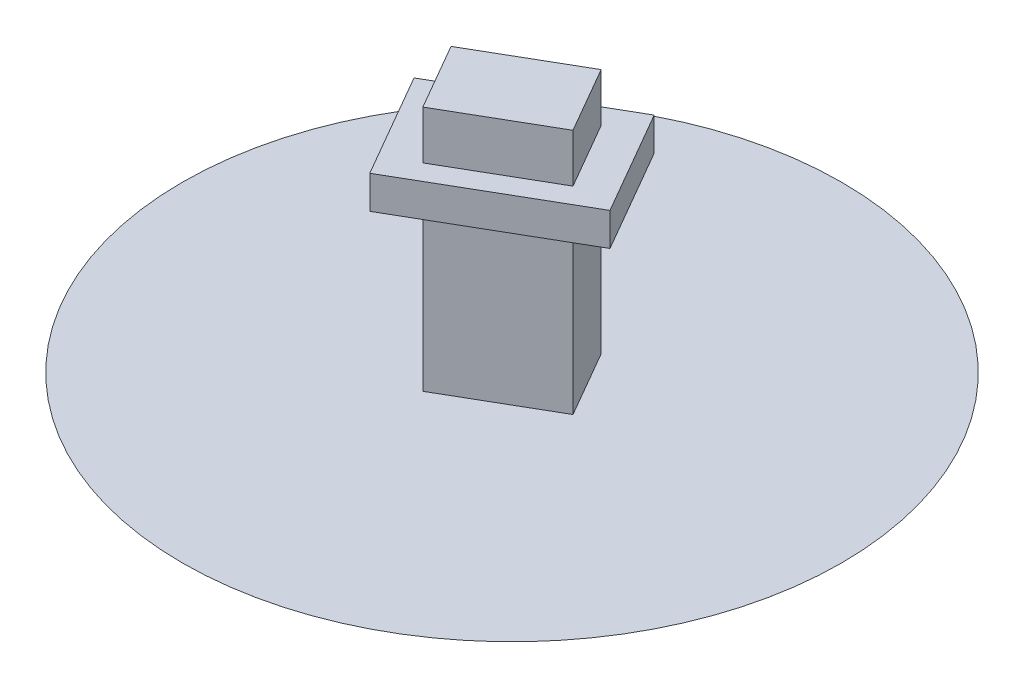
ISO-10303-21;
HEADER;
FILE_DESCRIPTION(('STEP AP214'),'2;1');
FILE_NAME('part.step','',(''),(''),'','','');
FILE_SCHEMA(('AUTOMOTIVE_DESIGN { 1 0 10303 214 1 1 1 1 }'));
ENDSEC;
DATA;
#1=APPLICATION_CONTEXT('core data for automotive mechanical design processes');
#2=APPLICATION_PROTOCOL_DEFINITION('international standard','automotive_design',2000,#1);
#3=PRODUCT_CONTEXT('',#1,'mechanical');
#4=PRODUCT('Part','Part','',(#3));
#5=PRODUCT_RELATED_PRODUCT_CATEGORY('part','',(#4));
#6=PRODUCT_DEFINITION_FORMATION('','',#4);
#7=PRODUCT_DEFINITION_CONTEXT('part definition',#1,'design');
#8=PRODUCT_DEFINITION('design','',#6,#7);
#9=PRODUCT_DEFINITION_SHAPE('','',#8);
#10=(LENGTH_UNIT() NAMED_UNIT(*) SI_UNIT(.MILLI.,.METRE.));
#11=(NAMED_UNIT(*) PLANE_ANGLE_UNIT() SI_UNIT($,.RADIAN.));
#12=(NAMED_UNIT(*) SI_UNIT($,.STERADIAN.) SOLID_ANGLE_UNIT());
#13=UNCERTAINTY_MEASURE_WITH_UNIT(LENGTH_MEASURE(1.E-05),#10,'distance_accuracy_value','');
#14=(GEOMETRIC_REPRESENTATION_CONTEXT(3) GLOBAL_UNCERTAINTY_ASSIGNED_CONTEXT((#13)) GLOBAL_UNIT_ASSIGNED_CONTEXT((#10,
#11,#12)) REPRESENTATION_CONTEXT('',''));
#15=CARTESIAN_POINT('',(0.,0.,0.));
#16=DIRECTION('',(0.,0.,1.));
#17=DIRECTION('',(1.,0.,0.));
#18=AXIS2_PLACEMENT_3D('',#15,#16,#17);
#19=CARTESIAN_POINT('',(-12258.3302491977,18000.,4767.94919243113));
#20=DIRECTION('',(0.,-1.,0.));
#21=DIRECTION('',(0.,0.,-1.));
#22=AXIS2_PLACEMENT_3D('',#19,#20,#21);
#23=PLANE('',#22);
#24=DIRECTION('',(0.5,0.,0.866025403784438));
#25=VECTOR('',#24,1.);
#26=CARTESIAN_POINT('',(-6758.33024919769,18000.,14294.2286340599));
#27=LINE('',#26,#25);
#28=CARTESIAN_POINT('',(-12258.3302491977,18000.,4767.94919243113));
#29=VERTEX_POINT('',#28);
#30=CARTESIAN_POINT('',(-6758.33024919769,18000.,14294.2286340599));
#31=VERTEX_POINT('',#30);
#32=EDGE_CURVE('E176',#29,#31,#27,.T.);
#33=ORIENTED_EDGE('',*,*,#32,.T.);
#34=DIRECTION('',(0.866025403784439,0.,-0.5));
#35=VECTOR('',#34,1.);
#36=CARTESIAN_POINT('',(7098.07621135332,18000.,6294.22863405995));
#37=LINE('',#36,#35);
#38=CARTESIAN_POINT('',(7098.07621135332,18000.,6294.22863405995));
#39=VERTEX_POINT('',#38);
#40=EDGE_CURVE('E174',#31,#39,#37,.T.);
#41=ORIENTED_EDGE('',*,*,#40,.T.);
#42=DIRECTION('',(-0.5,0.,-0.866025403784439));
#43=VECTOR('',#42,1.);
#44=CARTESIAN_POINT('',(1598.07621135332,18000.,-3232.05080756887));
#45=LINE('',#44,#43);
#46=CARTESIAN_POINT('',(1598.07621135332,18000.,-3232.05080756887));
#47=VERTEX_POINT('',#46);
#48=EDGE_CURVE('E172',#39,#47,#45,.T.);
#49=ORIENTED_EDGE('',*,*,#48,.T.);
#50=DIRECTION('',(-0.866025403784439,0.,0.5));
#51=VECTOR('',#50,1.);
#52=CARTESIAN_POINT('',(-12258.3302491977,18000.,4767.94919243113));
#53=LINE('',#52,#51);
#54=EDGE_CURVE('E170',#47,#29,#53,.T.);
#55=ORIENTED_EDGE('',*,*,#54,.T.);
#56=EDGE_LOOP('',(#33,#41,#49,#55));
#57=FACE_BOUND('',#56,.T.);
#58=DIRECTION('',(-0.866025403784438,0.,0.500000000000001));
#59=VECTOR('',#58,1.);
#60=CARTESIAN_POINT('',(-8660.25403784438,18000.,5000.00000000001));
#61=LINE('',#60,#59);
#62=CARTESIAN_POINT('',(0.,18000.,0.));
#63=VERTEX_POINT('',#62);
#64=CARTESIAN_POINT('',(-8660.25403784438,18000.,5000.00000000001));
#65=VERTEX_POINT('',#64);
#66=EDGE_CURVE('E215',#63,#65,#61,.T.);
#67=ORIENTED_EDGE('',*,*,#66,.F.);
#68=DIRECTION('',(-0.500000000000002,0.,-0.866025403784438));
#69=VECTOR('',#68,1.);
#70=CARTESIAN_POINT('',(0.,18000.,0.));
#71=LINE('',#70,#69);
#72=CARTESIAN_POINT('',(3500.00000000002,18000.,6062.17782649106));
#73=VERTEX_POINT('',#72);
#74=EDGE_CURVE('E208',#73,#63,#71,.T.);
#75=ORIENTED_EDGE('',*,*,#74,.F.);
#76=DIRECTION('',(0.866025403784438,0.,-0.500000000000002));
#77=VECTOR('',#76,1.);
#78=CARTESIAN_POINT('',(3500.00000000001,18000.,6062.17782649106));
#79=LINE('',#78,#77);
#80=CARTESIAN_POINT('',(-5160.25403784437,18000.,11062.1778264911));
#81=VERTEX_POINT('',#80);
#82=EDGE_CURVE('E211',#81,#73,#79,.T.);
#83=ORIENTED_EDGE('',*,*,#82,.F.);
#84=DIRECTION('',(0.500000000000002,0.,0.866025403784438));
#85=VECTOR('',#84,1.);
#86=CARTESIAN_POINT('',(-5160.25403784437,18000.,11062.1778264911));
#87=LINE('',#86,#85);
#88=EDGE_CURVE('E52',#65,#81,#87,.T.);
#89=ORIENTED_EDGE('',*,*,#88,.F.);
#90=EDGE_LOOP('',(#67,#75,#83,#89));
#91=FACE_BOUND('',#90,.T.);
#92=ADVANCED_FACE('F30',(#57,#91),#23,.F.);
#93=CARTESIAN_POINT('',(3500.00000000001,15000.,6062.17782649106));
#94=DIRECTION('',(-0.866025403784438,0.,0.500000000000002));
#95=DIRECTION('',(0.500000000000002,0.,0.866025403784438));
#96=AXIS2_PLACEMENT_3D('',#93,#94,#95);
#97=PLANE('',#96);
#98=DIRECTION('',(0.,-1.,0.));
#99=VECTOR('',#98,1.);
#100=CARTESIAN_POINT('',(3500.00000000001,15000.,6062.17782649106));
#101=LINE('',#100,#99);
#102=CARTESIAN_POINT('',(3500.00000000001,15000.,6062.17782649106));
#103=VERTEX_POINT('',#102);
#104=CARTESIAN_POINT('',(3500.00000000001,0.00999999999962142,6062.17782649106));
#105=VERTEX_POINT('',#104);
#106=EDGE_CURVE('E137',#103,#105,#101,.T.);
#107=ORIENTED_EDGE('',*,*,#106,.T.);
#108=DIRECTION('',(-0.500000000000002,0.,-0.866025403784438));
#109=VECTOR('',#108,1.);
#110=CARTESIAN_POINT('',(3500.00000000001,0.00999999999962142,6062.17782649106));
#111=LINE('',#110,#109);
#112=CARTESIAN_POINT('',(0.,0.00999999999962142,0.));
#113=VERTEX_POINT('',#112);
#114=EDGE_CURVE('E45',#105,#113,#111,.T.);
#115=ORIENTED_EDGE('',*,*,#114,.T.);
#116=DIRECTION('',(0.,-1.,0.));
#117=VECTOR('',#116,1.);
#118=CARTESIAN_POINT('',(0.,15000.,0.));
#119=LINE('',#118,#117);
#120=CARTESIAN_POINT('',(0.,15000.,0.));
#121=VERTEX_POINT('',#120);
#122=EDGE_CURVE('E38',#121,#113,#119,.T.);
#123=ORIENTED_EDGE('',*,*,#122,.F.);
#124=DIRECTION('',(-0.500000000000002,0.,-0.866025403784438));
#125=VECTOR('',#124,1.);
#126=CARTESIAN_POINT('',(3500.00000000001,15000.,6062.17782649106));
#127=LINE('',#126,#125);
#128=EDGE_CURVE('E150',#103,#121,#127,.T.);
#129=ORIENTED_EDGE('',*,*,#128,.F.);
#130=EDGE_LOOP('',(#107,#115,#123,#129));
#131=FACE_BOUND('',#130,.T.);
#132=ADVANCED_FACE('F32',(#131),#97,.F.);
#133=CARTESIAN_POINT('',(0.,15000.,0.));
#134=DIRECTION('',(0.500000000000001,0.,0.866025403784438));
#135=DIRECTION('',(0.866025403784438,0.,-0.500000000000001));
#136=AXIS2_PLACEMENT_3D('',#133,#134,#135);
#137=PLANE('',#136);
#138=ORIENTED_EDGE('',*,*,#122,.T.);
#139=DIRECTION('',(-0.866025403784438,0.,0.500000000000001));
#140=VECTOR('',#139,1.);
#141=CARTESIAN_POINT('',(0.,0.00999999999962142,0.));
#142=LINE('',#141,#140);
#143=CARTESIAN_POINT('',(-8660.25403784438,0.00999999999962142,5000.00000000001));
#144=VERTEX_POINT('',#143);
#145=EDGE_CURVE('E130',#113,#144,#142,.T.);
#146=ORIENTED_EDGE('',*,*,#145,.T.);
#147=DIRECTION('',(0.,-1.,0.));
#148=VECTOR('',#147,1.);
#149=CARTESIAN_POINT('',(-8660.25403784438,15000.,5000.00000000001));
#150=LINE('',#149,#148);
#151=CARTESIAN_POINT('',(-8660.25403784438,15000.,5000.00000000001));
#152=VERTEX_POINT('',#151);
#153=EDGE_CURVE('E129',#152,#144,#150,.T.);
#154=ORIENTED_EDGE('',*,*,#153,.F.);
#155=DIRECTION('',(-0.866025403784438,0.,0.500000000000001));
#156=VECTOR('',#155,1.);
#157=CARTESIAN_POINT('',(0.,15000.,0.));
#158=LINE('',#157,#156);
#159=EDGE_CURVE('E147',#121,#152,#158,.T.);
#160=ORIENTED_EDGE('',*,*,#159,.F.);
#161=EDGE_LOOP('',(#138,#146,#154,#160));
#162=FACE_BOUND('',#161,.T.);
#163=ADVANCED_FACE('F145',(#162),#137,.F.);
#164=CARTESIAN_POINT('',(-8660.25403784438,15000.,5000.00000000001));
#165=DIRECTION('',(0.866025403784438,0.,-0.500000000000001));
#166=DIRECTION('',(-0.500000000000002,0.,-0.866025403784438));
#167=AXIS2_PLACEMENT_3D('',#164,#165,#166);
#168=PLANE('',#167);
#169=ORIENTED_EDGE('',*,*,#153,.T.);
#170=DIRECTION('',(0.500000000000002,0.,0.866025403784438));
#171=VECTOR('',#170,1.);
#172=CARTESIAN_POINT('',(-8660.25403784438,0.00999999999962142,5000.00000000001));
#173=LINE('',#172,#171);
#174=CARTESIAN_POINT('',(-5160.25403784437,0.00999999999962142,11062.1778264911));
#175=VERTEX_POINT('',#174);
#176=EDGE_CURVE('E117',#144,#175,#173,.T.);
#177=ORIENTED_EDGE('',*,*,#176,.T.);
#178=DIRECTION('',(0.,-1.,0.));
#179=VECTOR('',#178,1.);
#180=CARTESIAN_POINT('',(-5160.25403784437,15000.,11062.1778264911));
#181=LINE('',#180,#179);
#182=CARTESIAN_POINT('',(-5160.25403784437,15000.,11062.1778264911));
#183=VERTEX_POINT('',#182);
#184=EDGE_CURVE('E127',#183,#175,#181,.T.);
#185=ORIENTED_EDGE('',*,*,#184,.F.);
#186=DIRECTION('',(0.500000000000002,0.,0.866025403784438));
#187=VECTOR('',#186,1.);
#188=CARTESIAN_POINT('',(-8660.25403784438,15000.,5000.00000000001));
#189=LINE('',#188,#187);
#190=EDGE_CURVE('E155',#152,#183,#189,.T.);
#191=ORIENTED_EDGE('',*,*,#190,.F.);
#192=EDGE_LOOP('',(#169,#177,#185,#191));
#193=FACE_BOUND('',#192,.T.);
#194=ADVANCED_FACE('F125',(#193),#168,.F.);
#195=CARTESIAN_POINT('',(-5160.25403784437,15000.,11062.1778264911));
#196=DIRECTION('',(-0.500000000000002,0.,-0.866025403784438));
#197=DIRECTION('',(-0.866025403784438,0.,0.500000000000002));
#198=AXIS2_PLACEMENT_3D('',#195,#196,#197);
#199=PLANE('',#198);
#200=ORIENTED_EDGE('',*,*,#184,.T.);
#201=DIRECTION('',(0.866025403784438,0.,-0.500000000000002));
#202=VECTOR('',#201,1.);
#203=CARTESIAN_POINT('',(-5160.25403784437,0.00999999999962142,11062.1778264911));
#204=LINE('',#203,#202);
#205=EDGE_CURVE('E11',#175,#105,#204,.T.);
#206=ORIENTED_EDGE('',*,*,#205,.T.);
#207=ORIENTED_EDGE('',*,*,#106,.F.);
#208=DIRECTION('',(0.866025403784438,0.,-0.500000000000002));
#209=VECTOR('',#208,1.);
#210=CARTESIAN_POINT('',(-5160.25403784437,15000.,11062.1778264911));
#211=LINE('',#210,#209);
#212=EDGE_CURVE('E135',#183,#103,#211,.T.);
#213=ORIENTED_EDGE('',*,*,#212,.F.);
#214=EDGE_LOOP('',(#200,#206,#207,#213));
#215=FACE_BOUND('',#214,.T.);
#216=ADVANCED_FACE('F133',(#215),#199,.F.);
#217=CARTESIAN_POINT('',(-12258.3302491977,15000.,4767.94919243113));
#218=DIRECTION('',(0.,-1.,0.));
#219=DIRECTION('',(0.,0.,-1.));
#220=AXIS2_PLACEMENT_3D('',#217,#218,#219);
#221=PLANE('',#220);
#222=DIRECTION('',(0.5,0.,0.866025403784438));
#223=VECTOR('',#222,1.);
#224=CARTESIAN_POINT('',(-6758.33024919769,15000.,14294.2286340599));
#225=LINE('',#224,#223);
#226=CARTESIAN_POINT('',(-12258.3302491977,15000.,4767.94919243113));
#227=VERTEX_POINT('',#226);
#228=CARTESIAN_POINT('',(-6758.33024919769,15000.,14294.2286340599));
#229=VERTEX_POINT('',#228);
#230=EDGE_CURVE('E185',#227,#229,#225,.T.);
#231=ORIENTED_EDGE('',*,*,#230,.F.);
#232=DIRECTION('',(-0.866025403784439,0.,0.5));
#233=VECTOR('',#232,1.);
#234=CARTESIAN_POINT('',(-12258.3302491977,15000.,4767.94919243113));
#235=LINE('',#234,#233);
#236=CARTESIAN_POINT('',(1598.07621135332,15000.,-3232.05080756887));
#237=VERTEX_POINT('',#236);
#238=EDGE_CURVE('E179',#237,#227,#235,.T.);
#239=ORIENTED_EDGE('',*,*,#238,.F.);
#240=DIRECTION('',(-0.5,0.,-0.866025403784439));
#241=VECTOR('',#240,1.);
#242=CARTESIAN_POINT('',(1598.07621135332,15000.,-3232.05080756887));
#243=LINE('',#242,#241);
#244=CARTESIAN_POINT('',(7098.07621135332,15000.,6294.22863405995));
#245=VERTEX_POINT('',#244);
#246=EDGE_CURVE('E181',#245,#237,#243,.T.);
#247=ORIENTED_EDGE('',*,*,#246,.F.);
#248=DIRECTION('',(0.866025403784439,0.,-0.5));
#249=VECTOR('',#248,1.);
#250=CARTESIAN_POINT('',(7098.07621135332,15000.,6294.22863405995));
#251=LINE('',#250,#249);
#252=EDGE_CURVE('E183',#229,#245,#251,.T.);
#253=ORIENTED_EDGE('',*,*,#252,.F.);
#254=EDGE_LOOP('',(#231,#239,#247,#253));
#255=FACE_BOUND('',#254,.T.);
#256=ORIENTED_EDGE('',*,*,#128,.T.);
#257=ORIENTED_EDGE('',*,*,#159,.T.);
#258=ORIENTED_EDGE('',*,*,#190,.T.);
#259=ORIENTED_EDGE('',*,*,#212,.T.);
#260=EDGE_LOOP('',(#256,#257,#258,#259));
#261=FACE_BOUND('',#260,.T.);
#262=ADVANCED_FACE('F152',(#255,#261),#221,.T.);
#263=CARTESIAN_POINT('',(-6758.33024919769,18000.,14294.2286340599));
#264=DIRECTION('',(0.866025403784438,0.,-0.5));
#265=DIRECTION('',(-0.5,0.,-0.866025403784438));
#266=AXIS2_PLACEMENT_3D('',#263,#264,#265);
#267=PLANE('',#266);
#268=ORIENTED_EDGE('',*,*,#230,.T.);
#269=DIRECTION('',(0.,-1.,0.));
#270=VECTOR('',#269,1.);
#271=CARTESIAN_POINT('',(-6758.33024919769,18000.,14294.2286340599));
#272=LINE('',#271,#270);
#273=EDGE_CURVE('E153',#31,#229,#272,.T.);
#274=ORIENTED_EDGE('',*,*,#273,.F.);
#275=ORIENTED_EDGE('',*,*,#32,.F.);
#276=DIRECTION('',(0.,-1.,0.));
#277=VECTOR('',#276,1.);
#278=CARTESIAN_POINT('',(-12258.3302491977,18000.,4767.94919243113));
#279=LINE('',#278,#277);
#280=EDGE_CURVE('E167',#29,#227,#279,.T.);
#281=ORIENTED_EDGE('',*,*,#280,.T.);
#282=EDGE_LOOP('',(#268,#274,#275,#281));
#283=FACE_BOUND('',#282,.T.);
#284=ADVANCED_FACE('F260',(#283),#267,.F.);
#285=CARTESIAN_POINT('',(7098.07621135332,18000.,6294.22863405995));
#286=DIRECTION('',(-0.5,0.,-0.866025403784439));
#287=DIRECTION('',(-0.866025403784439,0.,0.5));
#288=AXIS2_PLACEMENT_3D('',#285,#286,#287);
#289=PLANE('',#288);
#290=ORIENTED_EDGE('',*,*,#252,.T.);
#291=DIRECTION('',(0.,-1.,0.));
#292=VECTOR('',#291,1.);
#293=CARTESIAN_POINT('',(7098.07621135332,18000.,6294.22863405995));
#294=LINE('',#293,#292);
#295=EDGE_CURVE('E158',#39,#245,#294,.T.);
#296=ORIENTED_EDGE('',*,*,#295,.F.);
#297=ORIENTED_EDGE('',*,*,#40,.F.);
#298=ORIENTED_EDGE('',*,*,#273,.T.);
#299=EDGE_LOOP('',(#290,#296,#297,#298));
#300=FACE_BOUND('',#299,.T.);
#301=ADVANCED_FACE('F257',(#300),#289,.F.);
#302=CARTESIAN_POINT('',(1598.07621135332,18000.,-3232.05080756887));
#303=DIRECTION('',(-0.866025403784439,0.,0.5));
#304=DIRECTION('',(0.5,0.,0.866025403784439));
#305=AXIS2_PLACEMENT_3D('',#302,#303,#304);
#306=PLANE('',#305);
#307=ORIENTED_EDGE('',*,*,#246,.T.);
#308=DIRECTION('',(0.,-1.,0.));
#309=VECTOR('',#308,1.);
#310=CARTESIAN_POINT('',(1598.07621135332,18000.,-3232.05080756887));
#311=LINE('',#310,#309);
#312=EDGE_CURVE('E164',#47,#237,#311,.T.);
#313=ORIENTED_EDGE('',*,*,#312,.F.);
#314=ORIENTED_EDGE('',*,*,#48,.F.);
#315=ORIENTED_EDGE('',*,*,#295,.T.);
#316=EDGE_LOOP('',(#307,#313,#314,#315));
#317=FACE_BOUND('',#316,.T.);
#318=ADVANCED_FACE('F253',(#317),#306,.F.);
#319=CARTESIAN_POINT('',(-12258.3302491977,18000.,4767.94919243113));
#320=DIRECTION('',(0.5,0.,0.866025403784438));
#321=DIRECTION('',(0.866025403784439,0.,-0.5));
#322=AXIS2_PLACEMENT_3D('',#319,#320,#321);
#323=PLANE('',#322);
#324=ORIENTED_EDGE('',*,*,#238,.T.);
#325=ORIENTED_EDGE('',*,*,#280,.F.);
#326=ORIENTED_EDGE('',*,*,#54,.F.);
#327=ORIENTED_EDGE('',*,*,#312,.T.);
#328=EDGE_LOOP('',(#324,#325,#326,#327));
#329=FACE_BOUND('',#328,.T.);
#330=ADVANCED_FACE('F249',(#329),#323,.F.);
#331=CARTESIAN_POINT('',(-8660.25403784438,22400.,5000.00000000001));
#332=DIRECTION('',(0.500000000000001,0.,0.866025403784438));
#333=DIRECTION('',(0.866025403784438,0.,-0.500000000000001));
#334=AXIS2_PLACEMENT_3D('',#331,#332,#333);
#335=PLANE('',#334);
#336=ORIENTED_EDGE('',*,*,#66,.T.);
#337=DIRECTION('',(0.,-1.,0.));
#338=VECTOR('',#337,1.);
#339=CARTESIAN_POINT('',(-8660.25403784438,22400.,5000.00000000001));
#340=LINE('',#339,#338);
#341=CARTESIAN_POINT('',(-8660.25403784438,22400.,5000.00000000001));
#342=VERTEX_POINT('',#341);
#343=EDGE_CURVE('E188',#342,#65,#340,.T.);
#344=ORIENTED_EDGE('',*,*,#343,.F.);
#345=DIRECTION('',(-0.866025403784438,0.,0.500000000000001));
#346=VECTOR('',#345,1.);
#347=CARTESIAN_POINT('',(-8660.25403784438,22400.,5000.00000000001));
#348=LINE('',#347,#346);
#349=CARTESIAN_POINT('',(0.,22400.,0.));
#350=VERTEX_POINT('',#349);
#351=EDGE_CURVE('E205',#350,#342,#348,.T.);
#352=ORIENTED_EDGE('',*,*,#351,.F.);
#353=DIRECTION('',(0.,-1.,0.));
#354=VECTOR('',#353,1.);
#355=CARTESIAN_POINT('',(0.,22400.,0.));
#356=LINE('',#355,#354);
#357=EDGE_CURVE('E196',#350,#63,#356,.T.);
#358=ORIENTED_EDGE('',*,*,#357,.T.);
#359=EDGE_LOOP('',(#336,#344,#352,#358));
#360=FACE_BOUND('',#359,.T.);
#361=ADVANCED_FACE('F252',(#360),#335,.F.);
#362=CARTESIAN_POINT('',(-5160.25403784437,22400.,11062.1778264911));
#363=DIRECTION('',(0.866025403784438,0.,-0.500000000000002));
#364=DIRECTION('',(-0.500000000000002,0.,-0.866025403784438));
#365=AXIS2_PLACEMENT_3D('',#362,#363,#364);
#366=PLANE('',#365);
#367=ORIENTED_EDGE('',*,*,#88,.T.);
#368=DIRECTION('',(0.,-1.,0.));
#369=VECTOR('',#368,1.);
#370=CARTESIAN_POINT('',(-5160.25403784437,22400.,11062.1778264911));
#371=LINE('',#370,#369);
#372=CARTESIAN_POINT('',(-5160.25403784437,22400.,11062.1778264911));
#373=VERTEX_POINT('',#372);
#374=EDGE_CURVE('E190',#373,#81,#371,.T.);
#375=ORIENTED_EDGE('',*,*,#374,.F.);
#376=DIRECTION('',(0.500000000000002,0.,0.866025403784438));
#377=VECTOR('',#376,1.);
#378=CARTESIAN_POINT('',(-5160.25403784437,22400.,11062.1778264911));
#379=LINE('',#378,#377);
#380=EDGE_CURVE('E203',#342,#373,#379,.T.);
#381=ORIENTED_EDGE('',*,*,#380,.F.);
#382=ORIENTED_EDGE('',*,*,#343,.T.);
#383=EDGE_LOOP('',(#367,#375,#381,#382));
#384=FACE_BOUND('',#383,.T.);
#385=ADVANCED_FACE('F359',(#384),#366,.F.);
#386=CARTESIAN_POINT('',(3500.00000000001,22400.,6062.17782649106));
#387=DIRECTION('',(-0.500000000000002,0.,-0.866025403784438));
#388=DIRECTION('',(-0.866025403784438,0.,0.500000000000002));
#389=AXIS2_PLACEMENT_3D('',#386,#387,#388);
#390=PLANE('',#389);
#391=ORIENTED_EDGE('',*,*,#82,.T.);
#392=DIRECTION('',(0.,-1.,0.));
#393=VECTOR('',#392,1.);
#394=CARTESIAN_POINT('',(3500.00000000001,22400.,6062.17782649106));
#395=LINE('',#394,#393);
#396=CARTESIAN_POINT('',(3500.00000000001,22400.,6062.17782649106));
#397=VERTEX_POINT('',#396);
#398=EDGE_CURVE('E193',#397,#73,#395,.T.);
#399=ORIENTED_EDGE('',*,*,#398,.F.);
#400=DIRECTION('',(0.866025403784438,0.,-0.500000000000002));
#401=VECTOR('',#400,1.);
#402=CARTESIAN_POINT('',(3500.00000000001,22400.,6062.17782649106));
#403=LINE('',#402,#401);
#404=EDGE_CURVE('E201',#373,#397,#403,.T.);
#405=ORIENTED_EDGE('',*,*,#404,.F.);
#406=ORIENTED_EDGE('',*,*,#374,.T.);
#407=EDGE_LOOP('',(#391,#399,#405,#406));
#408=FACE_BOUND('',#407,.T.);
#409=ADVANCED_FACE('F367',(#408),#390,.F.);
#410=CARTESIAN_POINT('',(0.,22400.,0.));
#411=DIRECTION('',(-0.866025403784438,0.,0.500000000000002));
#412=DIRECTION('',(0.500000000000002,0.,0.866025403784438));
#413=AXIS2_PLACEMENT_3D('',#410,#411,#412);
#414=PLANE('',#413);
#415=ORIENTED_EDGE('',*,*,#74,.T.);
#416=ORIENTED_EDGE('',*,*,#357,.F.);
#417=DIRECTION('',(-0.500000000000002,0.,-0.866025403784438));
#418=VECTOR('',#417,1.);
#419=CARTESIAN_POINT('',(0.,22400.,0.));
#420=LINE('',#419,#418);
#421=EDGE_CURVE('E199',#397,#350,#420,.T.);
#422=ORIENTED_EDGE('',*,*,#421,.F.);
#423=ORIENTED_EDGE('',*,*,#398,.T.);
#424=EDGE_LOOP('',(#415,#416,#422,#423));
#425=FACE_BOUND('',#424,.T.);
#426=ADVANCED_FACE('F376',(#425),#414,.F.);
#427=CARTESIAN_POINT('',(-8660.25403784438,22400.,5000.00000000001));
#428=DIRECTION('',(0.,1.,0.));
#429=DIRECTION('',(0.,0.,1.));
#430=AXIS2_PLACEMENT_3D('',#427,#428,#429);
#431=PLANE('',#430);
#432=ORIENTED_EDGE('',*,*,#351,.T.);
#433=ORIENTED_EDGE('',*,*,#380,.T.);
#434=ORIENTED_EDGE('',*,*,#404,.T.);
#435=ORIENTED_EDGE('',*,*,#421,.T.);
#436=EDGE_LOOP('',(#432,#433,#434,#435));
#437=FACE_BOUND('',#436,.T.);
#438=ADVANCED_FACE('F308',(#437),#431,.T.);
#439=CARTESIAN_POINT('',(-2580.12701892218,0.01,5531.08891324554));
#440=DIRECTION('',(0.,1.,0.));
#441=DIRECTION('',(0.,0.,1.));
#442=AXIS2_PLACEMENT_3D('',#439,#440,#441);
#443=PLANE('',#442);
#444=CARTESIAN_POINT('',(-2580.12701892218,0.01,5531.08891324554));
#445=DIRECTION('',(0.,1.,0.));
#446=DIRECTION('',(0.,0.,1.));
#447=AXIS2_PLACEMENT_3D('',#444,#445,#446);
#448=CIRCLE('',#447,30000.);
#449=CARTESIAN_POINT('',(-2580.12701892218,0.01,35531.0889132455));
#450=VERTEX_POINT('',#449);
#451=EDGE_CURVE('E131',#450,#450,#448,.T.);
#452=ORIENTED_EDGE('',*,*,#451,.T.);
#453=EDGE_LOOP('',(#452));
#454=FACE_BOUND('',#453,.T.);
#455=ORIENTED_EDGE('',*,*,#114,.F.);
#456=ORIENTED_EDGE('',*,*,#205,.F.);
#457=ORIENTED_EDGE('',*,*,#176,.F.);
#458=ORIENTED_EDGE('',*,*,#145,.F.);
#459=EDGE_LOOP('',(#455,#456,#457,#458));
#460=FACE_BOUND('',#459,.T.);
#461=ADVANCED_FACE('F116',(#454,#460),#443,.T.);
#462=CARTESIAN_POINT('',(-2580.12701892218,0.01,5531.08891324554));
#463=DIRECTION('',(0.,-1.,0.));
#464=DIRECTION('',(0.,0.,-1.));
#465=AXIS2_PLACEMENT_3D('',#462,#463,#464);
#466=CYLINDRICAL_SURFACE('',#465,30000.);
#467=ORIENTED_EDGE('',*,*,#451,.F.);
#468=EDGE_LOOP('',(#467));
#469=FACE_BOUND('',#468,.T.);
#470=CARTESIAN_POINT('',(-2580.12701892218,0.,5531.08891324554));
#471=DIRECTION('',(0.,1.,0.));
#472=DIRECTION('',(0.,0.,1.));
#473=AXIS2_PLACEMENT_3D('',#470,#471,#472);
#474=CIRCLE('',#473,30000.);
#475=CARTESIAN_POINT('',(-2580.12701892218,0.,35531.0889132455));
#476=VERTEX_POINT('',#475);
#477=EDGE_CURVE('E220',#476,#476,#474,.T.);
#478=ORIENTED_EDGE('',*,*,#477,.T.);
#479=EDGE_LOOP('',(#478));
#480=FACE_BOUND('',#479,.T.);
#481=ADVANCED_FACE('F227',(#469,#480),#466,.T.);
#482=CARTESIAN_POINT('',(3500.00000000001,0.,6062.17782649106));
#483=DIRECTION('',(0.,-1.,0.));
#484=DIRECTION('',(0.,0.,-1.));
#485=AXIS2_PLACEMENT_3D('',#482,#483,#484);
#486=PLANE('',#485);
#487=ORIENTED_EDGE('',*,*,#477,.F.);
#488=EDGE_LOOP('',(#487));
#489=FACE_BOUND('',#488,.T.);
#490=ADVANCED_FACE('F230',(#489),#486,.T.);
#491=CLOSED_SHELL('',(#92,#132,#163,#194,#216,#262,#284,#301,#318,#330,#361,#385,#409,#426,#438,
#461,#481,#490));
#492=MANIFOLD_SOLID_BREP('B2',#491);
#493=ADVANCED_BREP_SHAPE_REPRESENTATION('',(#18,#492),#14);
#494=SHAPE_DEFINITION_REPRESENTATION(#9,#493);
ENDSEC;
END-ISO-10303-21;
